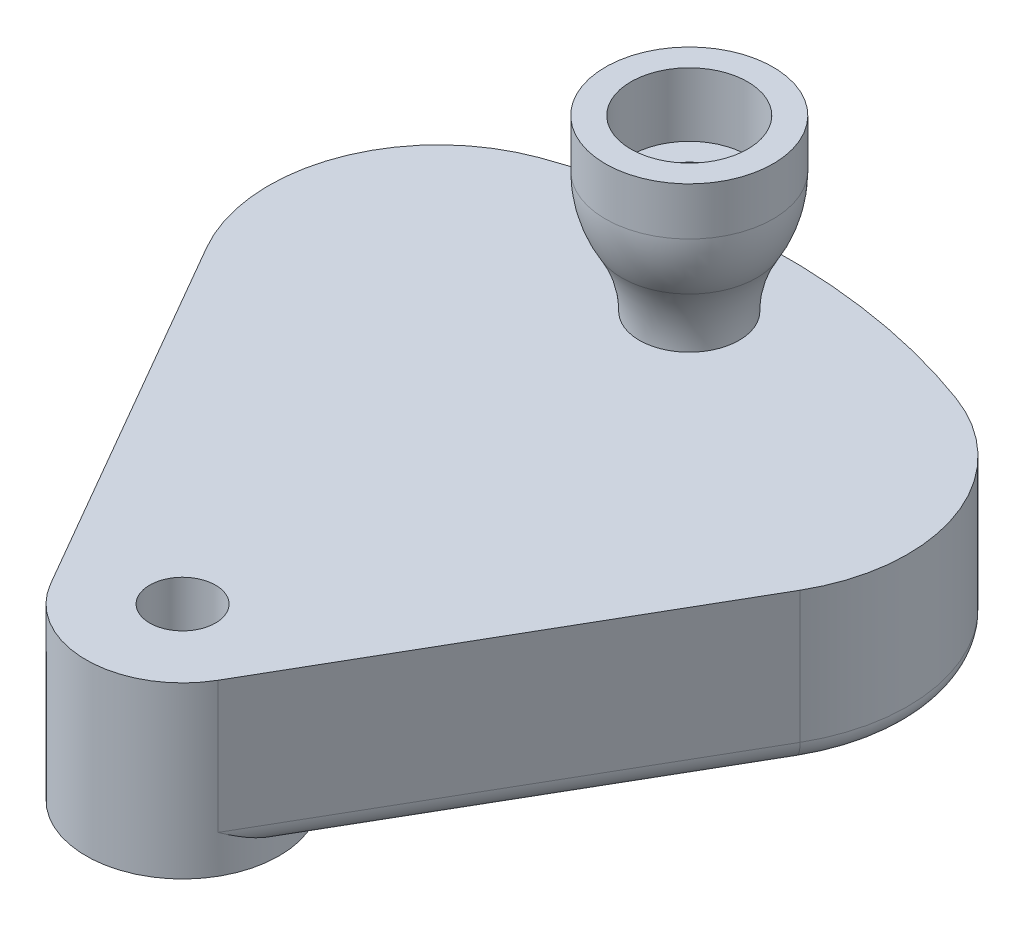
ISO-10303-21;
HEADER;
FILE_DESCRIPTION(('STEP AP214'),'2;1');
FILE_NAME('part.step','',(''),(''),'','','');
FILE_SCHEMA(('AUTOMOTIVE_DESIGN { 1 0 10303 214 1 1 1 1 }'));
ENDSEC;
DATA;
#1=APPLICATION_CONTEXT('core data for automotive mechanical design processes');
#2=APPLICATION_PROTOCOL_DEFINITION('international standard','automotive_design',2000,#1);
#3=PRODUCT_CONTEXT('',#1,'mechanical');
#4=PRODUCT('Part','Part','',(#3));
#5=PRODUCT_RELATED_PRODUCT_CATEGORY('part','',(#4));
#6=PRODUCT_DEFINITION_FORMATION('','',#4);
#7=PRODUCT_DEFINITION_CONTEXT('part definition',#1,'design');
#8=PRODUCT_DEFINITION('design','',#6,#7);
#9=PRODUCT_DEFINITION_SHAPE('','',#8);
#10=(LENGTH_UNIT() NAMED_UNIT(*) SI_UNIT(.MILLI.,.METRE.));
#11=(NAMED_UNIT(*) PLANE_ANGLE_UNIT() SI_UNIT($,.RADIAN.));
#12=(NAMED_UNIT(*) SI_UNIT($,.STERADIAN.) SOLID_ANGLE_UNIT());
#13=UNCERTAINTY_MEASURE_WITH_UNIT(LENGTH_MEASURE(1.E-05),#10,'distance_accuracy_value','');
#14=(GEOMETRIC_REPRESENTATION_CONTEXT(3) GLOBAL_UNCERTAINTY_ASSIGNED_CONTEXT((#13)) GLOBAL_UNIT_ASSIGNED_CONTEXT((#10,
#11,#12)) REPRESENTATION_CONTEXT('',''));
#15=CARTESIAN_POINT('',(0.,0.,0.));
#16=DIRECTION('',(0.,0.,1.));
#17=DIRECTION('',(1.,0.,0.));
#18=AXIS2_PLACEMENT_3D('',#15,#16,#17);
#19=CARTESIAN_POINT('',(0.,15.4876145564649,-23.867278685133));
#20=DIRECTION('',(0.,1.,0.));
#21=DIRECTION('',(0.,0.,1.));
#22=AXIS2_PLACEMENT_3D('',#19,#20,#21);
#23=CYLINDRICAL_SURFACE('',#22,1.55);
#24=CARTESIAN_POINT('',(0.,8.,-23.867278685133));
#25=DIRECTION('',(0.,1.,0.));
#26=DIRECTION('',(0.,0.,1.));
#27=AXIS2_PLACEMENT_3D('',#24,#25,#26);
#28=CIRCLE('',#27,1.55);
#29=CARTESIAN_POINT('',(0.,8.,-22.317278685133));
#30=VERTEX_POINT('',#29);
#31=EDGE_CURVE('E79',#30,#30,#28,.T.);
#32=ORIENTED_EDGE('',*,*,#31,.F.);
#33=EDGE_LOOP('',(#32));
#34=FACE_BOUND('',#33,.T.);
#35=CARTESIAN_POINT('',(0.,13.,-23.867278685133));
#36=DIRECTION('',(0.,1.,0.));
#37=DIRECTION('',(0.,0.,1.));
#38=AXIS2_PLACEMENT_3D('',#35,#36,#37);
#39=CIRCLE('',#38,1.55);
#40=CARTESIAN_POINT('',(0.,13.,-22.317278685133));
#41=VERTEX_POINT('',#40);
#42=EDGE_CURVE('E11',#41,#41,#39,.T.);
#43=ORIENTED_EDGE('',*,*,#42,.T.);
#44=EDGE_LOOP('',(#43));
#45=FACE_BOUND('',#44,.T.);
#46=ADVANCED_FACE('F51',(#34,#45),#23,.F.);
#47=CARTESIAN_POINT('',(0.,13.,-26.617278685133));
#48=DIRECTION('',(0.,-1.,0.));
#49=DIRECTION('',(0.,0.,-1.));
#50=AXIS2_PLACEMENT_3D('',#47,#48,#49);
#51=PLANE('',#50);
#52=ORIENTED_EDGE('',*,*,#42,.F.);
#53=EDGE_LOOP('',(#52));
#54=FACE_BOUND('',#53,.T.);
#55=CARTESIAN_POINT('',(0.,13.,-23.867278685133));
#56=DIRECTION('',(0.,1.,0.));
#57=DIRECTION('',(0.,0.,1.));
#58=AXIS2_PLACEMENT_3D('',#55,#56,#57);
#59=CIRCLE('',#58,2.75);
#60=CARTESIAN_POINT('',(0.,13.,-21.117278685133));
#61=VERTEX_POINT('',#60);
#62=EDGE_CURVE('E57',#61,#61,#59,.T.);
#63=ORIENTED_EDGE('',*,*,#62,.T.);
#64=EDGE_LOOP('',(#63));
#65=FACE_BOUND('',#64,.T.);
#66=ADVANCED_FACE('F86',(#54,#65),#51,.F.);
#67=CARTESIAN_POINT('',(0.,15.4876145564649,-23.867278685133));
#68=DIRECTION('',(0.,1.,0.));
#69=DIRECTION('',(0.,0.,1.));
#70=AXIS2_PLACEMENT_3D('',#67,#68,#69);
#71=CYLINDRICAL_SURFACE('',#70,2.75);
#72=ORIENTED_EDGE('',*,*,#62,.F.);
#73=EDGE_LOOP('',(#72));
#74=FACE_BOUND('',#73,.T.);
#75=CARTESIAN_POINT('',(0.,16.,-23.867278685133));
#76=DIRECTION('',(0.,1.,0.));
#77=DIRECTION('',(0.,0.,1.));
#78=AXIS2_PLACEMENT_3D('',#75,#76,#77);
#79=CIRCLE('',#78,2.75);
#80=CARTESIAN_POINT('',(0.,16.,-21.117278685133));
#81=VERTEX_POINT('',#80);
#82=EDGE_CURVE('E61',#81,#81,#79,.T.);
#83=ORIENTED_EDGE('',*,*,#82,.T.);
#84=EDGE_LOOP('',(#83));
#85=FACE_BOUND('',#84,.T.);
#86=ADVANCED_FACE('F90',(#74,#85),#71,.F.);
#87=CARTESIAN_POINT('',(0.,16.,-27.817278685133));
#88=DIRECTION('',(0.,-1.,0.));
#89=DIRECTION('',(0.,0.,-1.));
#90=AXIS2_PLACEMENT_3D('',#87,#88,#89);
#91=PLANE('',#90);
#92=ORIENTED_EDGE('',*,*,#82,.F.);
#93=EDGE_LOOP('',(#92));
#94=FACE_BOUND('',#93,.T.);
#95=CARTESIAN_POINT('',(0.,16.,-23.867278685133));
#96=DIRECTION('',(0.,1.,0.));
#97=DIRECTION('',(0.,0.,1.));
#98=AXIS2_PLACEMENT_3D('',#95,#96,#97);
#99=CIRCLE('',#98,3.95);
#100=CARTESIAN_POINT('',(0.,16.,-19.917278685133));
#101=VERTEX_POINT('',#100);
#102=EDGE_CURVE('E65',#101,#101,#99,.T.);
#103=ORIENTED_EDGE('',*,*,#102,.T.);
#104=EDGE_LOOP('',(#103));
#105=FACE_BOUND('',#104,.T.);
#106=ADVANCED_FACE('F95',(#94,#105),#91,.F.);
#107=CARTESIAN_POINT('',(0.,15.4876145564649,-23.867278685133));
#108=DIRECTION('',(0.,1.,0.));
#109=DIRECTION('',(0.,0.,1.));
#110=AXIS2_PLACEMENT_3D('',#107,#108,#109);
#111=CYLINDRICAL_SURFACE('',#110,3.95);
#112=ORIENTED_EDGE('',*,*,#102,.F.);
#113=EDGE_LOOP('',(#112));
#114=FACE_BOUND('',#113,.T.);
#115=CARTESIAN_POINT('',(0.,13.7490096920199,-23.867278685133));
#116=DIRECTION('',(0.,1.,0.));
#117=DIRECTION('',(0.,0.,1.));
#118=AXIS2_PLACEMENT_3D('',#115,#116,#117);
#119=CIRCLE('',#118,3.95);
#120=CARTESIAN_POINT('',(0.,13.7490096920199,-19.917278685133));
#121=VERTEX_POINT('',#120);
#122=EDGE_CURVE('E70',#121,#121,#119,.T.);
#123=ORIENTED_EDGE('',*,*,#122,.T.);
#124=EDGE_LOOP('',(#123));
#125=FACE_BOUND('',#124,.T.);
#126=ADVANCED_FACE('F101',(#114,#125),#111,.T.);
#127=CARTESIAN_POINT('',(0.,13.7490096920199,-23.867278685133));
#128=DIRECTION('',(0.,1.,0.));
#129=DIRECTION('',(0.,0.,1.));
#130=AXIS2_PLACEMENT_3D('',#127,#128,#129);
#131=DEGENERATE_TOROIDAL_SURFACE('',#130,1.45788075780529,5.40788075780529,.F.);
#132=ORIENTED_EDGE('',*,*,#122,.F.);
#133=EDGE_LOOP('',(#132));
#134=FACE_BOUND('',#133,.T.);
#135=CARTESIAN_POINT('',(0.,10.9552787009338,-23.867278685133));
#136=DIRECTION('',(0.,1.,0.));
#137=DIRECTION('',(0.,0.,1.));
#138=AXIS2_PLACEMENT_3D('',#135,#136,#137);
#139=CIRCLE('',#138,3.17248007479577);
#140=CARTESIAN_POINT('',(0.,10.9552787009338,-20.6947986103372));
#141=VERTEX_POINT('',#140);
#142=EDGE_CURVE('E73',#141,#141,#139,.T.);
#143=ORIENTED_EDGE('',*,*,#142,.T.);
#144=EDGE_LOOP('',(#143));
#145=FACE_BOUND('',#144,.T.);
#146=ADVANCED_FACE('F105',(#134,#145),#131,.F.);
#147=CARTESIAN_POINT('',(0.,8.,-23.867278685133));
#148=DIRECTION('',(0.,1.,0.));
#149=DIRECTION('',(0.,0.,1.));
#150=AXIS2_PLACEMENT_3D('',#147,#148,#149);
#151=TOROIDAL_SURFACE('',#150,8.07059187936306,5.72059187936306);
#152=ORIENTED_EDGE('',*,*,#142,.F.);
#153=EDGE_LOOP('',(#152));
#154=FACE_BOUND('',#153,.T.);
#155=CARTESIAN_POINT('',(0.,8.,-23.867278685133));
#156=DIRECTION('',(0.,1.,0.));
#157=DIRECTION('',(0.,0.,1.));
#158=AXIS2_PLACEMENT_3D('',#155,#156,#157);
#159=CIRCLE('',#158,2.35);
#160=CARTESIAN_POINT('',(0.,8.,-21.517278685133));
#161=VERTEX_POINT('',#160);
#162=EDGE_CURVE('E76',#161,#161,#159,.T.);
#163=ORIENTED_EDGE('',*,*,#162,.T.);
#164=EDGE_LOOP('',(#163));
#165=FACE_BOUND('',#164,.T.);
#166=ADVANCED_FACE('F109',(#154,#165),#151,.F.);
#167=CARTESIAN_POINT('',(0.,8.,-25.417278685133));
#168=DIRECTION('',(0.,1.,0.));
#169=DIRECTION('',(0.,0.,1.));
#170=AXIS2_PLACEMENT_3D('',#167,#168,#169);
#171=PLANE('',#170);
#172=ORIENTED_EDGE('',*,*,#162,.F.);
#173=EDGE_LOOP('',(#172));
#174=FACE_BOUND('',#173,.T.);
#175=ORIENTED_EDGE('',*,*,#31,.T.);
#176=EDGE_LOOP('',(#175));
#177=FACE_BOUND('',#176,.T.);
#178=ADVANCED_FACE('F83',(#174,#177),#171,.F.);
#179=CLOSED_SHELL('',(#46,#66,#86,#106,#126,#146,#166,#178));
#180=MANIFOLD_SOLID_BREP('B2',#179);
#181=CARTESIAN_POINT('',(0.,8.,0.));
#182=DIRECTION('',(0.,-1.,0.));
#183=DIRECTION('',(0.,0.,-1.));
#184=AXIS2_PLACEMENT_3D('',#181,#182,#183);
#185=PLANE('',#184);
#186=CARTESIAN_POINT('',(0.,8.,-23.867278685133));
#187=DIRECTION('',(0.,1.,0.));
#188=DIRECTION('',(0.,0.,1.));
#189=AXIS2_PLACEMENT_3D('',#186,#187,#188);
#190=CIRCLE('',#189,1.25);
#191=CARTESIAN_POINT('',(0.,8.,-22.617278685133));
#192=VERTEX_POINT('',#191);
#193=EDGE_CURVE('E487',#192,#192,#190,.T.);
#194=ORIENTED_EDGE('',*,*,#193,.F.);
#195=EDGE_LOOP('',(#194));
#196=FACE_BOUND('',#195,.T.);
#197=DIRECTION('',(0.499999999999998,0.,0.86602540378444));
#198=VECTOR('',#197,1.);
#199=CARTESIAN_POINT('',(-17.9404155872191,8.,-21.9737113059643));
#200=LINE('',#199,#198);
#201=CARTESIAN_POINT('',(-13.976893318947,8.,-15.1086893603862));
#202=VERTEX_POINT('',#201);
#203=CARTESIAN_POINT('',(-3.9404155872192,8.,2.27499999999999));
#204=VERTEX_POINT('',#203);
#205=EDGE_CURVE('E282',#202,#204,#200,.T.);
#206=ORIENTED_EDGE('',*,*,#205,.T.);
#207=CARTESIAN_POINT('',(0.,8.,0.));
#208=DIRECTION('',(0.,1.,0.));
#209=DIRECTION('',(0.,0.,1.));
#210=AXIS2_PLACEMENT_3D('',#207,#208,#209);
#211=CIRCLE('',#210,4.55);
#212=CARTESIAN_POINT('',(3.9404155872192,8.,2.27499999999999));
#213=VERTEX_POINT('',#212);
#214=EDGE_CURVE('E287',#204,#213,#211,.T.);
#215=ORIENTED_EDGE('',*,*,#214,.T.);
#216=DIRECTION('',(0.499999999999998,0.,-0.86602540378444));
#217=VECTOR('',#216,1.);
#218=CARTESIAN_POINT('',(3.9404155872192,8.,2.27499999999999));
#219=LINE('',#218,#217);
#220=CARTESIAN_POINT('',(13.976893318947,8.,-15.1086893603862));
#221=VERTEX_POINT('',#220);
#222=EDGE_CURVE('E307',#213,#221,#219,.T.);
#223=ORIENTED_EDGE('',*,*,#222,.T.);
#224=CARTESIAN_POINT('',(7.04869008867144,8.,-19.1086893603862));
#225=DIRECTION('',(0.,-1.,0.));
#226=DIRECTION('',(0.,0.,-1.));
#227=AXIS2_PLACEMENT_3D('',#224,#225,#226);
#228=CIRCLE('',#227,8.);
#229=CARTESIAN_POINT('',(9.81732312900652,8.,-26.6143319769757));
#230=VERTEX_POINT('',#229);
#231=EDGE_CURVE('E319',#221,#230,#228,.F.);
#232=ORIENTED_EDGE('',*,*,#231,.T.);
#233=CARTESIAN_POINT('',(0.,8.,0.));
#234=DIRECTION('',(0.,1.,0.));
#235=DIRECTION('',(0.,0.,-1.));
#236=AXIS2_PLACEMENT_3D('',#233,#234,#235);
#237=CIRCLE('',#236,28.367278685133);
#238=CARTESIAN_POINT('',(-9.81732312900651,8.,-26.6143319769757));
#239=VERTEX_POINT('',#238);
#240=EDGE_CURVE('E294',#230,#239,#237,.T.);
#241=ORIENTED_EDGE('',*,*,#240,.T.);
#242=CARTESIAN_POINT('',(-7.04869008867144,8.,-19.1086893603862));
#243=DIRECTION('',(0.,-1.,0.));
#244=DIRECTION('',(0.,0.,-1.));
#245=AXIS2_PLACEMENT_3D('',#242,#243,#244);
#246=CIRCLE('',#245,8.);
#247=EDGE_CURVE('E290',#239,#202,#246,.F.);
#248=ORIENTED_EDGE('',*,*,#247,.T.);
#249=EDGE_LOOP('',(#206,#215,#223,#232,#241,#248));
#250=FACE_BOUND('',#249,.T.);
#251=CARTESIAN_POINT('',(0.,8.,0.));
#252=DIRECTION('',(0.,1.,0.));
#253=DIRECTION('',(0.,0.,1.));
#254=AXIS2_PLACEMENT_3D('',#251,#252,#253);
#255=CIRCLE('',#254,1.55);
#256=CARTESIAN_POINT('',(0.,8.,1.55));
#257=VERTEX_POINT('',#256);
#258=EDGE_CURVE('E479',#257,#257,#255,.T.);
#259=ORIENTED_EDGE('',*,*,#258,.F.);
#260=EDGE_LOOP('',(#259));
#261=FACE_BOUND('',#260,.T.);
#262=ADVANCED_FACE('F172',(#196,#250,#261),#185,.F.);
#263=CARTESIAN_POINT('',(0.,0.,0.));
#264=DIRECTION('',(0.,-1.,0.));
#265=DIRECTION('',(0.,0.,-1.));
#266=AXIS2_PLACEMENT_3D('',#263,#264,#265);
#267=PLANE('',#266);
#268=CARTESIAN_POINT('',(0.,0.,-23.867278685133));
#269=DIRECTION('',(0.,-1.,0.));
#270=DIRECTION('',(0.,0.,-1.));
#271=AXIS2_PLACEMENT_3D('',#268,#269,#270);
#272=CIRCLE('',#271,1.25);
#273=CARTESIAN_POINT('',(0.,0.,-25.117278685133));
#274=VERTEX_POINT('',#273);
#275=EDGE_CURVE('E177',#274,#274,#272,.T.);
#276=ORIENTED_EDGE('',*,*,#275,.F.);
#277=EDGE_LOOP('',(#276));
#278=FACE_BOUND('',#277,.T.);
#279=CARTESIAN_POINT('',(0.,0.,0.));
#280=DIRECTION('',(0.,1.,0.));
#281=DIRECTION('',(0.,0.,1.));
#282=AXIS2_PLACEMENT_3D('',#279,#280,#281);
#283=CIRCLE('',#282,4.55);
#284=CARTESIAN_POINT('',(-3.35847888113417,0.,-3.06971001968847));
#285=VERTEX_POINT('',#284);
#286=CARTESIAN_POINT('',(3.35847888113417,0.,-3.06971001968847));
#287=VERTEX_POINT('',#286);
#288=EDGE_CURVE('E450',#285,#287,#283,.T.);
#289=ORIENTED_EDGE('',*,*,#288,.F.);
#290=DIRECTION('',(-0.499999999999998,0.,-0.86602540378444));
#291=VECTOR('',#290,1.);
#292=CARTESIAN_POINT('',(-1.18963573119971,0.,0.686836509645749));
#293=LINE('',#292,#291);
#294=CARTESIAN_POINT('',(-11.2261134629275,0.,-16.6968528507405));
#295=VERTEX_POINT('',#294);
#296=EDGE_CURVE('E350',#285,#295,#293,.T.);
#297=ORIENTED_EDGE('',*,*,#296,.T.);
#298=CARTESIAN_POINT('',(-7.04869008867144,0.,-19.1086893603862));
#299=DIRECTION('',(0.,-1.,0.));
#300=DIRECTION('',(0.,0.,-1.));
#301=AXIS2_PLACEMENT_3D('',#298,#299,#300);
#302=CIRCLE('',#301,4.8236730192915);
#303=CARTESIAN_POINT('',(-8.71806265079435,0.,-23.6342850831471));
#304=VERTEX_POINT('',#303);
#305=EDGE_CURVE('E348',#295,#304,#302,.T.);
#306=ORIENTED_EDGE('',*,*,#305,.T.);
#307=CARTESIAN_POINT('',(0.,0.,0.));
#308=DIRECTION('',(0.,-1.,0.));
#309=DIRECTION('',(0.,0.,-1.));
#310=AXIS2_PLACEMENT_3D('',#307,#308,#309);
#311=CIRCLE('',#310,25.1909517044245);
#312=CARTESIAN_POINT('',(8.71806265079436,0.,-23.6342850831471));
#313=VERTEX_POINT('',#312);
#314=EDGE_CURVE('E346',#304,#313,#311,.T.);
#315=ORIENTED_EDGE('',*,*,#314,.T.);
#316=CARTESIAN_POINT('',(7.04869008867144,0.,-19.1086893603862));
#317=DIRECTION('',(0.,-1.,0.));
#318=DIRECTION('',(0.,0.,-1.));
#319=AXIS2_PLACEMENT_3D('',#316,#317,#318);
#320=CIRCLE('',#319,4.8236730192915);
#321=CARTESIAN_POINT('',(11.2261134629275,0.,-16.6968528507405));
#322=VERTEX_POINT('',#321);
#323=EDGE_CURVE('E344',#313,#322,#320,.T.);
#324=ORIENTED_EDGE('',*,*,#323,.T.);
#325=DIRECTION('',(-0.499999999999998,0.,0.86602540378444));
#326=VECTOR('',#325,1.);
#327=CARTESIAN_POINT('',(1.18963573119971,0.,0.686836509645747));
#328=LINE('',#327,#326);
#329=EDGE_CURVE('E341',#322,#287,#328,.T.);
#330=ORIENTED_EDGE('',*,*,#329,.T.);
#331=EDGE_LOOP('',(#289,#297,#306,#315,#324,#330));
#332=FACE_BOUND('',#331,.T.);
#333=CARTESIAN_POINT('',(0.,0.,0.));
#334=DIRECTION('',(0.,1.,0.));
#335=DIRECTION('',(0.,0.,1.));
#336=AXIS2_PLACEMENT_3D('',#333,#334,#335);
#337=CIRCLE('',#336,1.55);
#338=CARTESIAN_POINT('',(0.,0.,1.55));
#339=VERTEX_POINT('',#338);
#340=EDGE_CURVE('E338',#339,#339,#337,.T.);
#341=ORIENTED_EDGE('',*,*,#340,.T.);
#342=EDGE_LOOP('',(#341));
#343=FACE_BOUND('',#342,.T.);
#344=ADVANCED_FACE('F496',(#278,#332,#343),#267,.T.);
#345=CARTESIAN_POINT('',(0.,8.,0.));
#346=DIRECTION('',(0.,-1.,0.));
#347=DIRECTION('',(0.,0.,-1.));
#348=AXIS2_PLACEMENT_3D('',#345,#346,#347);
#349=CYLINDRICAL_SURFACE('',#348,28.367278685133);
#350=DIRECTION('',(0.,-1.,0.));
#351=VECTOR('',#350,1.);
#352=CARTESIAN_POINT('',(9.81732312900652,8.,-26.6143319769757));
#353=LINE('',#352,#351);
#354=CARTESIAN_POINT('',(9.81732312900652,1.79211824100832,-26.6143319769757));
#355=VERTEX_POINT('',#354);
#356=EDGE_CURVE('E314',#230,#355,#353,.T.);
#357=ORIENTED_EDGE('',*,*,#356,.T.);
#358=CARTESIAN_POINT('',(0.,1.79211824100832,0.));
#359=DIRECTION('',(0.,-1.,0.));
#360=DIRECTION('',(0.,0.,-1.));
#361=AXIS2_PLACEMENT_3D('',#358,#359,#360);
#362=CIRCLE('',#361,28.367278685133);
#363=CARTESIAN_POINT('',(-9.81732312900652,1.79211824100832,-26.6143319769757));
#364=VERTEX_POINT('',#363);
#365=EDGE_CURVE('E372',#355,#364,#362,.F.);
#366=ORIENTED_EDGE('',*,*,#365,.T.);
#367=DIRECTION('',(0.,-1.,0.));
#368=VECTOR('',#367,1.);
#369=CARTESIAN_POINT('',(-9.81732312900652,8.,-26.6143319769757));
#370=LINE('',#369,#368);
#371=EDGE_CURVE('E317',#364,#239,#370,.F.);
#372=ORIENTED_EDGE('',*,*,#371,.T.);
#373=ORIENTED_EDGE('',*,*,#240,.F.);
#374=EDGE_LOOP('',(#357,#366,#372,#373));
#375=FACE_BOUND('',#374,.T.);
#376=ADVANCED_FACE('F477',(#375),#349,.T.);
#377=CARTESIAN_POINT('',(-17.9404155872191,8.,-21.9737113059643));
#378=DIRECTION('',(0.86602540378444,0.,-0.499999999999998));
#379=DIRECTION('',(-0.499999999999998,0.,-0.86602540378444));
#380=AXIS2_PLACEMENT_3D('',#377,#378,#379);
#381=PLANE('',#380);
#382=DIRECTION('',(0.,-1.,0.));
#383=VECTOR('',#382,1.);
#384=CARTESIAN_POINT('',(-13.976893318947,8.,-15.1086893603862));
#385=LINE('',#384,#383);
#386=CARTESIAN_POINT('',(-13.976893318947,1.79211824100832,-15.1086893603862));
#387=VERTEX_POINT('',#386);
#388=EDGE_CURVE('E302',#202,#387,#385,.T.);
#389=ORIENTED_EDGE('',*,*,#388,.T.);
#390=DIRECTION('',(0.499999999999998,0.,0.86602540378444));
#391=VECTOR('',#390,1.);
#392=CARTESIAN_POINT('',(-3.9404155872192,1.79211824100832,2.27499999999998));
#393=LINE('',#392,#391);
#394=CARTESIAN_POINT('',(-3.9404155872192,1.79211824100832,2.27499999999999));
#395=VERTEX_POINT('',#394);
#396=EDGE_CURVE('E301',#387,#395,#393,.T.);
#397=ORIENTED_EDGE('',*,*,#396,.T.);
#398=DIRECTION('',(0.,-1.,0.));
#399=VECTOR('',#398,1.);
#400=CARTESIAN_POINT('',(-3.9404155872192,8.,2.27499999999999));
#401=LINE('',#400,#399);
#402=EDGE_CURVE('E298',#204,#395,#401,.T.);
#403=ORIENTED_EDGE('',*,*,#402,.F.);
#404=ORIENTED_EDGE('',*,*,#205,.F.);
#405=EDGE_LOOP('',(#389,#397,#403,#404));
#406=FACE_BOUND('',#405,.T.);
#407=ADVANCED_FACE('F299',(#406),#381,.F.);
#408=CARTESIAN_POINT('',(0.,8.,0.));
#409=DIRECTION('',(0.,-1.,0.));
#410=DIRECTION('',(0.,0.,-1.));
#411=AXIS2_PLACEMENT_3D('',#408,#409,#410);
#412=CYLINDRICAL_SURFACE('',#411,4.55);
#413=ORIENTED_EDGE('',*,*,#402,.T.);
#414=CARTESIAN_POINT('',(-4.54900666334772,0.852425620222415,-0.0950703782363094));
#415=CARTESIAN_POINT('',(-4.55010571434,0.862346137581803,-0.0424861391402874));
#416=CARTESIAN_POINT('',(-4.55028849061516,0.873276055037117,0.00991146269022516));
#417=CARTESIAN_POINT('',(-4.54886430917114,0.896923986708722,0.114259091968286));
#418=CARTESIAN_POINT('',(-4.54725798348769,0.9096413680815,0.16620927094517));
#419=CARTESIAN_POINT('',(-4.53982899682654,0.950089988190823,0.321138995866665));
#420=CARTESIAN_POINT('',(-4.53140011118991,0.980156587716704,0.423395190455355));
#421=CARTESIAN_POINT('',(-4.50798230002393,1.04494428748881,0.62520660053963));
#422=CARTESIAN_POINT('',(-4.49301700204717,1.07964831383882,0.724770185265424));
#423=CARTESIAN_POINT('',(-4.45684533873488,1.15270081774431,0.921426668253095));
#424=CARTESIAN_POINT('',(-4.43563590091341,1.19105108316026,1.01851832456599));
#425=CARTESIAN_POINT('',(-4.35982884287327,1.3154774984093,1.3186533439724));
#426=CARTESIAN_POINT('',(-4.29463144654445,1.40639001953374,1.51708341582195));
#427=CARTESIAN_POINT('',(-4.13909692317108,1.5936825113926,1.90084370641525));
#428=CARTESIAN_POINT('',(-4.04877461403283,1.69005923291548,2.08618156600332));
#429=CARTESIAN_POINT('',(-3.94448249098935,1.78830060948113,2.26794496552112));
#430=CARTESIAN_POINT('',(-3.94245138138668,1.79020944482287,2.27147388027036));
#431=CARTESIAN_POINT('',(-3.94041558721918,1.79211824100832,2.27500000000002));
#432=B_SPLINE_CURVE_WITH_KNOTS('',3,(#414,#415,#416,#417,#418,#419,#420,#421,#422,#423,#424,
#425,#426,#427,#428,#429,#430,#431),.UNSPECIFIED.,.F.,.F.,(4,2,2,2,2,2,2,2,4),(0.,
0.16052686298664,0.320997034658452,0.641335844223975,0.960526167564304,1.27987381467197,
1.96110136865856,2.64192800415997,2.65541875169016),.UNSPECIFIED.);
#433=CARTESIAN_POINT('',(-4.54900666334772,0.852425620222415,-0.0950703782363095));
#434=VERTEX_POINT('',#433);
#435=EDGE_CURVE('E390',#395,#434,#432,.F.);
#436=ORIENTED_EDGE('',*,*,#435,.T.);
#437=CARTESIAN_POINT('',(0.,-0.564153863112596,0.));
#438=DIRECTION('',(-0.296198132726022,-0.939692620785909,0.171010071662833));
#439=DIRECTION('',(-0.813797681349376,0.342020143325667,0.469846310392953));
#440=AXIS2_PLACEMENT_3D('',#437,#438,#439);
#441=ELLIPSE('',#440,4.8420088647654,4.55);
#442=CARTESIAN_POINT('',(-3.59289917922499,0.0603073792140919,-2.79169759965588));
#443=VERTEX_POINT('',#442);
#444=EDGE_CURVE('E324',#434,#443,#441,.T.);
#445=ORIENTED_EDGE('',*,*,#444,.T.);
#446=CARTESIAN_POINT('',(-3.59289917922499,0.0603073792140917,-2.79169759965588));
#447=CARTESIAN_POINT('',(-3.57489686009448,0.0504145452792157,-2.81487027104703));
#448=CARTESIAN_POINT('',(-3.5564239989736,0.0416866660734862,-2.8381782799374));
#449=CARTESIAN_POINT('',(-3.51876849897644,0.026692147244714,-2.88472755820842));
#450=CARTESIAN_POINT('',(-3.49959166660288,0.020408868968025,-2.90796817057368));
#451=CARTESIAN_POINT('',(-3.46050604697851,0.0102953919880944,-2.95437264324323));
#452=CARTESIAN_POINT('',(-3.44059721705439,0.00646533654109237,-2.97753649898676));
#453=CARTESIAN_POINT('',(-3.40003501164597,0.00130775565283234,-3.02377592812745));
#454=CARTESIAN_POINT('',(-3.37937740958721,-2.11764915086206E-06,-3.04684975710325));
#455=CARTESIAN_POINT('',(-3.35847888113417,0.,-3.06971001968847));
#456=B_SPLINE_CURVE_WITH_KNOTS('',3,(#446,#447,#448,#449,#450,#451,#452,#453,#454,#455),
.UNSPECIFIED.,.F.,.F.,(4,2,2,2,4),(0.,0.0928777321668178,0.185111765339495,0.277351184038618,
0.370234357302657),.UNSPECIFIED.);
#457=EDGE_CURVE('E381',#443,#285,#456,.T.);
#458=ORIENTED_EDGE('',*,*,#457,.T.);
#459=ORIENTED_EDGE('',*,*,#288,.T.);
#460=CARTESIAN_POINT('',(3.35847888113416,0.,-3.06971001968847));
#461=CARTESIAN_POINT('',(3.37937740958721,-2.11764915120358E-06,-3.04684975710325));
#462=CARTESIAN_POINT('',(3.40003501164596,0.00130775565283195,-3.02377592812745));
#463=CARTESIAN_POINT('',(3.44059721705439,0.00646533654109208,-2.97753649898676));
#464=CARTESIAN_POINT('',(3.46050604697851,0.0102953919880943,-2.95437264324324));
#465=CARTESIAN_POINT('',(3.49959166660288,0.020408868968025,-2.90796817057368));
#466=CARTESIAN_POINT('',(3.51876849897644,0.0266921472447138,-2.88472755820842));
#467=CARTESIAN_POINT('',(3.5564239989736,0.0416866660734857,-2.8381782799374));
#468=CARTESIAN_POINT('',(3.57489686009448,0.0504145452792149,-2.81487027104703));
#469=CARTESIAN_POINT('',(3.59289917922499,0.0603073792140906,-2.79169759965588));
#470=B_SPLINE_CURVE_WITH_KNOTS('',3,(#460,#461,#462,#463,#464,#465,#466,#467,#468,#469),
.UNSPECIFIED.,.F.,.F.,(4,2,2,2,4),(0.,0.0928831732640387,0.185122591963163,0.27735662513584,
0.370234357302657),.UNSPECIFIED.);
#471=CARTESIAN_POINT('',(3.59289917922499,0.0603073792140908,-2.79169759965588));
#472=VERTEX_POINT('',#471);
#473=EDGE_CURVE('E182',#287,#472,#470,.T.);
#474=ORIENTED_EDGE('',*,*,#473,.T.);
#475=CARTESIAN_POINT('',(0.,-0.564153863112596,0.));
#476=DIRECTION('',(0.296198132726022,-0.939692620785909,0.171010071662833));
#477=DIRECTION('',(0.813797681349376,0.342020143325667,0.469846310392953));
#478=AXIS2_PLACEMENT_3D('',#475,#476,#477);
#479=ELLIPSE('',#478,4.8420088647654,4.55);
#480=CARTESIAN_POINT('',(4.54900666334772,0.852425620222414,-0.0950703782363123));
#481=VERTEX_POINT('',#480);
#482=EDGE_CURVE('E329',#472,#481,#479,.T.);
#483=ORIENTED_EDGE('',*,*,#482,.T.);
#484=CARTESIAN_POINT('',(4.54900666334772,0.852425620222415,-0.0950703782363117));
#485=CARTESIAN_POINT('',(4.55010571434,0.8623461375818,-0.0424861391403017));
#486=CARTESIAN_POINT('',(4.55028849061516,0.873276055037112,0.00991146269019861));
#487=CARTESIAN_POINT('',(4.54886430917115,0.896923986708712,0.114259091968236));
#488=CARTESIAN_POINT('',(4.5472579834877,0.909641368081487,0.166209270945108));
#489=CARTESIAN_POINT('',(4.53982899682655,0.9500899881908,0.321138995866573));
#490=CARTESIAN_POINT('',(4.53140011118992,0.98015658771667,0.423395190455246));
#491=CARTESIAN_POINT('',(4.50798230002395,1.04494428748877,0.625206600539524));
#492=CARTESIAN_POINT('',(4.49301700204718,1.0796483138388,0.724770185265338));
#493=CARTESIAN_POINT('',(4.45684533873489,1.15270081774429,0.921426668253056));
#494=CARTESIAN_POINT('',(4.43563590091341,1.19105108316023,1.01851832456598));
#495=CARTESIAN_POINT('',(4.35982884287328,1.31547749840935,1.31865334397237));
#496=CARTESIAN_POINT('',(4.29463144654454,1.40639001953408,1.51708341582181));
#497=CARTESIAN_POINT('',(4.139096923171,1.59368251139225,1.90084370641538));
#498=CARTESIAN_POINT('',(4.04877461403253,1.69005923291416,2.08618156600383));
#499=CARTESIAN_POINT('',(3.94448249098935,1.78830060948107,2.26794496552111));
#500=CARTESIAN_POINT('',(3.94245138138669,1.79020944482285,2.27147388027034));
#501=CARTESIAN_POINT('',(3.9404155872192,1.79211824100832,2.27499999999999));
#502=B_SPLINE_CURVE_WITH_KNOTS('',3,(#484,#485,#486,#487,#488,#489,#490,#491,#492,#493,#494,
#495,#496,#497,#498,#499,#500,#501),.UNSPECIFIED.,.F.,.F.,(4,2,2,2,2,2,2,2,4),(0.,
0.160526862986603,0.320997034658378,0.641335844223843,0.960526167564239,1.27987381467196,
1.96110136865856,2.64192800415994,2.65541875169013),.UNSPECIFIED.);
#503=CARTESIAN_POINT('',(3.9404155872192,1.79211824100832,2.27499999999999));
#504=VERTEX_POINT('',#503);
#505=EDGE_CURVE('E49',#481,#504,#502,.T.);
#506=ORIENTED_EDGE('',*,*,#505,.T.);
#507=DIRECTION('',(0.,-1.,0.));
#508=VECTOR('',#507,1.);
#509=CARTESIAN_POINT('',(3.9404155872192,8.,2.27499999999999));
#510=LINE('',#509,#508);
#511=EDGE_CURVE('E303',#213,#504,#510,.T.);
#512=ORIENTED_EDGE('',*,*,#511,.F.);
#513=ORIENTED_EDGE('',*,*,#214,.F.);
#514=EDGE_LOOP('',(#413,#436,#445,#458,#459,#474,#483,#506,#512,#513));
#515=FACE_BOUND('',#514,.T.);
#516=ADVANCED_FACE('F305',(#515),#412,.T.);
#517=CARTESIAN_POINT('',(3.9404155872192,8.,2.27499999999999));
#518=DIRECTION('',(-0.86602540378444,0.,-0.499999999999998));
#519=DIRECTION('',(-0.499999999999998,0.,0.86602540378444));
#520=AXIS2_PLACEMENT_3D('',#517,#518,#519);
#521=PLANE('',#520);
#522=ORIENTED_EDGE('',*,*,#511,.T.);
#523=DIRECTION('',(0.499999999999998,0.,-0.86602540378444));
#524=VECTOR('',#523,1.);
#525=CARTESIAN_POINT('',(13.976893318947,1.79211824100833,-15.1086893603862));
#526=LINE('',#525,#524);
#527=CARTESIAN_POINT('',(13.976893318947,1.79211824100833,-15.1086893603862));
#528=VERTEX_POINT('',#527);
#529=EDGE_CURVE('E379',#504,#528,#526,.T.);
#530=ORIENTED_EDGE('',*,*,#529,.T.);
#531=DIRECTION('',(0.,-1.,0.));
#532=VECTOR('',#531,1.);
#533=CARTESIAN_POINT('',(13.976893318947,8.,-15.1086893603862));
#534=LINE('',#533,#532);
#535=EDGE_CURVE('E322',#528,#221,#534,.F.);
#536=ORIENTED_EDGE('',*,*,#535,.T.);
#537=ORIENTED_EDGE('',*,*,#222,.F.);
#538=EDGE_LOOP('',(#522,#530,#536,#537));
#539=FACE_BOUND('',#538,.T.);
#540=ADVANCED_FACE('F470',(#539),#521,.F.);
#541=CARTESIAN_POINT('',(0.,8.,0.));
#542=DIRECTION('',(0.,-1.,0.));
#543=DIRECTION('',(0.,0.,-1.));
#544=AXIS2_PLACEMENT_3D('',#541,#542,#543);
#545=CYLINDRICAL_SURFACE('',#544,1.55);
#546=ORIENTED_EDGE('',*,*,#258,.T.);
#547=EDGE_LOOP('',(#546));
#548=FACE_BOUND('',#547,.T.);
#549=ORIENTED_EDGE('',*,*,#340,.F.);
#550=EDGE_LOOP('',(#549));
#551=FACE_BOUND('',#550,.T.);
#552=ADVANCED_FACE('F503',(#548,#551),#545,.F.);
#553=CARTESIAN_POINT('',(-7.04869008867144,8.,-19.1086893603862));
#554=DIRECTION('',(0.,-1.,0.));
#555=DIRECTION('',(0.,0.,-1.));
#556=AXIS2_PLACEMENT_3D('',#553,#554,#555);
#557=CYLINDRICAL_SURFACE('',#556,8.);
#558=ORIENTED_EDGE('',*,*,#371,.F.);
#559=CARTESIAN_POINT('',(-7.04869008867144,1.79211824100832,-19.1086893603862));
#560=DIRECTION('',(0.,-1.,0.));
#561=DIRECTION('',(0.,0.,-1.));
#562=AXIS2_PLACEMENT_3D('',#559,#560,#561);
#563=CIRCLE('',#562,8.);
#564=EDGE_CURVE('E370',#364,#387,#563,.F.);
#565=ORIENTED_EDGE('',*,*,#564,.T.);
#566=ORIENTED_EDGE('',*,*,#388,.F.);
#567=ORIENTED_EDGE('',*,*,#247,.F.);
#568=EDGE_LOOP('',(#558,#565,#566,#567));
#569=FACE_BOUND('',#568,.T.);
#570=ADVANCED_FACE('F505',(#569),#557,.T.);
#571=CARTESIAN_POINT('',(7.04869008867144,8.,-19.1086893603862));
#572=DIRECTION('',(0.,-1.,0.));
#573=DIRECTION('',(0.,0.,-1.));
#574=AXIS2_PLACEMENT_3D('',#571,#572,#573);
#575=CYLINDRICAL_SURFACE('',#574,8.);
#576=ORIENTED_EDGE('',*,*,#535,.F.);
#577=CARTESIAN_POINT('',(7.04869008867144,1.79211824100832,-19.1086893603862));
#578=DIRECTION('',(0.,-1.,0.));
#579=DIRECTION('',(0.,0.,-1.));
#580=AXIS2_PLACEMENT_3D('',#577,#578,#579);
#581=CIRCLE('',#580,8.);
#582=EDGE_CURVE('E374',#528,#355,#581,.F.);
#583=ORIENTED_EDGE('',*,*,#582,.T.);
#584=ORIENTED_EDGE('',*,*,#356,.F.);
#585=ORIENTED_EDGE('',*,*,#231,.F.);
#586=EDGE_LOOP('',(#576,#583,#584,#585));
#587=FACE_BOUND('',#586,.T.);
#588=ADVANCED_FACE('F473',(#587),#575,.T.);
#589=CARTESIAN_POINT('',(3.9404155872192,1.09191070279861,2.27499999999999));
#590=DIRECTION('',(0.296198132726022,-0.939692620785909,0.171010071662833));
#591=DIRECTION('',(-0.499999999999998,0.,0.86602540378444));
#592=AXIS2_PLACEMENT_3D('',#589,#590,#591);
#593=PLANE('',#592);
#594=ORIENTED_EDGE('',*,*,#482,.F.);
#595=DIRECTION('',(-0.499999999999998,0.,0.86602540378444));
#596=VECTOR('',#595,1.);
#597=CARTESIAN_POINT('',(1.48583386392573,0.060307379214091,0.857846581308579));
#598=LINE('',#597,#596);
#599=CARTESIAN_POINT('',(11.5223115956535,0.0603073792140899,-16.5258427790776));
#600=VERTEX_POINT('',#599);
#601=EDGE_CURVE('E377',#472,#600,#598,.F.);
#602=ORIENTED_EDGE('',*,*,#601,.T.);
#603=DIRECTION('',(-0.813797681349375,-0.342020143325667,-0.469846310392953));
#604=VECTOR('',#603,1.);
#605=CARTESIAN_POINT('',(13.976893318947,1.09191070279861,-15.1086893603862));
#606=LINE('',#605,#604);
#607=CARTESIAN_POINT('',(13.4070660478885,0.852425620222415,-15.4376792887234));
#608=VERTEX_POINT('',#607);
#609=EDGE_CURVE('E335',#608,#600,#606,.T.);
#610=ORIENTED_EDGE('',*,*,#609,.F.);
#611=DIRECTION('',(0.499999999999998,0.,-0.86602540378444));
#612=VECTOR('',#611,1.);
#613=CARTESIAN_POINT('',(3.37058831616078,0.852425620222415,1.94601007166282));
#614=LINE('',#613,#612);
#615=EDGE_CURVE('E196',#608,#481,#614,.F.);
#616=ORIENTED_EDGE('',*,*,#615,.T.);
#617=EDGE_LOOP('',(#594,#602,#610,#616));
#618=FACE_BOUND('',#617,.T.);
#619=ADVANCED_FACE('F408',(#618),#593,.T.);
#620=CARTESIAN_POINT('',(7.04869008867144,0.,-19.1086893603862));
#621=DIRECTION('',(0.,1.,0.));
#622=DIRECTION('',(0.,0.,1.));
#623=AXIS2_PLACEMENT_3D('',#620,#621,#622);
#624=CONICAL_SURFACE('',#623,4.99999999999997,1.22173047639603);
#625=ORIENTED_EDGE('',*,*,#609,.T.);
#626=CARTESIAN_POINT('',(7.04869008867144,0.0603073792140914,-19.1086893603862));
#627=DIRECTION('',(0.,-1.,0.));
#628=DIRECTION('',(0.,0.,-1.));
#629=AXIS2_PLACEMENT_3D('',#626,#627,#628);
#630=CIRCLE('',#629,5.16569316261717);
#631=CARTESIAN_POINT('',(8.8364286844533,0.0603073792140912,-23.9551702035818));
#632=VERTEX_POINT('',#631);
#633=EDGE_CURVE('E367',#600,#632,#630,.F.);
#634=ORIENTED_EDGE('',*,*,#633,.T.);
#635=DIRECTION('',(-0.325208004708366,-0.342020143325667,0.881624622633178));
#636=VECTOR('',#635,1.);
#637=CARTESIAN_POINT('',(9.81732312900652,1.09191070279861,-26.6143319769757));
#638=LINE('',#637,#636);
#639=CARTESIAN_POINT('',(9.58961003262358,0.852425620222413,-25.9970117703367));
#640=VERTEX_POINT('',#639);
#641=EDGE_CURVE('E332',#640,#632,#638,.T.);
#642=ORIENTED_EDGE('',*,*,#641,.F.);
#643=CARTESIAN_POINT('',(7.04869008867144,0.852425620222414,-19.1086893603862));
#644=DIRECTION('',(0.,-1.,0.));
#645=DIRECTION('',(0.,0.,-1.));
#646=AXIS2_PLACEMENT_3D('',#643,#644,#645);
#647=CIRCLE('',#646,7.34202014332567);
#648=EDGE_CURVE('E365',#640,#608,#647,.T.);
#649=ORIENTED_EDGE('',*,*,#648,.T.);
#650=EDGE_LOOP('',(#625,#634,#642,#649));
#651=FACE_BOUND('',#650,.T.);
#652=ADVANCED_FACE('F571',(#651),#624,.T.);
#653=CARTESIAN_POINT('',(-17.9404155872191,1.09191070279861,-21.9737113059643));
#654=DIRECTION('',(-0.296198132726022,-0.939692620785909,0.171010071662833));
#655=DIRECTION('',(-0.499999999999998,0.,-0.86602540378444));
#656=AXIS2_PLACEMENT_3D('',#653,#654,#655);
#657=PLANE('',#656);
#658=DIRECTION('',(-0.813797681349375,0.342020143325666,0.469846310392953));
#659=VECTOR('',#658,1.);
#660=CARTESIAN_POINT('',(-11.3788171075936,0.,-16.6086893603862));
#661=LINE('',#660,#659);
#662=CARTESIAN_POINT('',(-11.5223115956535,0.0603073792140904,-16.5258427790776));
#663=VERTEX_POINT('',#662);
#664=CARTESIAN_POINT('',(-13.4070660478885,0.852425620222412,-15.4376792887234));
#665=VERTEX_POINT('',#664);
#666=EDGE_CURVE('E328',#663,#665,#661,.T.);
#667=ORIENTED_EDGE('',*,*,#666,.F.);
#668=DIRECTION('',(-0.499999999999998,0.,-0.86602540378444));
#669=VECTOR('',#668,1.);
#670=CARTESIAN_POINT('',(-15.4858338639257,0.0603073792140919,-23.3908647246557));
#671=LINE('',#670,#669);
#672=EDGE_CURVE('E355',#663,#443,#671,.F.);
#673=ORIENTED_EDGE('',*,*,#672,.T.);
#674=ORIENTED_EDGE('',*,*,#444,.F.);
#675=DIRECTION('',(0.499999999999998,0.,0.86602540378444));
#676=VECTOR('',#675,1.);
#677=CARTESIAN_POINT('',(-13.4070660478885,0.852425620222415,-15.4376792887234));
#678=LINE('',#677,#676);
#679=EDGE_CURVE('E353',#434,#665,#678,.F.);
#680=ORIENTED_EDGE('',*,*,#679,.T.);
#681=EDGE_LOOP('',(#667,#673,#674,#680));
#682=FACE_BOUND('',#681,.T.);
#683=ADVANCED_FACE('F579',(#682),#657,.T.);
#684=CARTESIAN_POINT('',(0.,1.09191070279861,0.));
#685=DIRECTION('',(0.,1.,0.));
#686=DIRECTION('',(0.,0.,1.));
#687=AXIS2_PLACEMENT_3D('',#684,#685,#686);
#688=CONICAL_SURFACE('',#687,28.367278685133,1.22173047639603);
#689=ORIENTED_EDGE('',*,*,#641,.T.);
#690=CARTESIAN_POINT('',(0.,0.0603073792140897,0.));
#691=DIRECTION('',(0.,-1.,0.));
#692=DIRECTION('',(0.,0.,-1.));
#693=AXIS2_PLACEMENT_3D('',#690,#691,#692);
#694=CIRCLE('',#693,25.5329718477501);
#695=CARTESIAN_POINT('',(-8.8364286844533,0.0603073792140884,-23.9551702035818));
#696=VERTEX_POINT('',#695);
#697=EDGE_CURVE('E363',#632,#696,#694,.F.);
#698=ORIENTED_EDGE('',*,*,#697,.T.);
#699=DIRECTION('',(0.325208004708366,-0.342020143325667,0.881624622633178));
#700=VECTOR('',#699,1.);
#701=CARTESIAN_POINT('',(-9.81732312900651,1.09191070279861,-26.6143319769757));
#702=LINE('',#701,#700);
#703=CARTESIAN_POINT('',(-9.58961003262358,0.852425620222416,-25.9970117703367));
#704=VERTEX_POINT('',#703);
#705=EDGE_CURVE('E325',#704,#696,#702,.T.);
#706=ORIENTED_EDGE('',*,*,#705,.F.);
#707=CARTESIAN_POINT('',(0.,0.852425620222405,0.));
#708=DIRECTION('',(0.,1.,0.));
#709=DIRECTION('',(0.,0.,1.));
#710=AXIS2_PLACEMENT_3D('',#707,#708,#709);
#711=CIRCLE('',#710,27.7092988284586);
#712=EDGE_CURVE('E361',#704,#640,#711,.F.);
#713=ORIENTED_EDGE('',*,*,#712,.T.);
#714=EDGE_LOOP('',(#689,#698,#706,#713));
#715=FACE_BOUND('',#714,.T.);
#716=ADVANCED_FACE('F588',(#715),#688,.T.);
#717=CARTESIAN_POINT('',(-7.04869008867144,0.,-19.1086893603862));
#718=DIRECTION('',(0.,1.,0.));
#719=DIRECTION('',(0.,0.,1.));
#720=AXIS2_PLACEMENT_3D('',#717,#718,#719);
#721=CONICAL_SURFACE('',#720,4.99999999999997,1.22173047639603);
#722=ORIENTED_EDGE('',*,*,#705,.T.);
#723=CARTESIAN_POINT('',(-7.04869008867144,0.0603073792140914,-19.1086893603862));
#724=DIRECTION('',(0.,-1.,0.));
#725=DIRECTION('',(0.,0.,-1.));
#726=AXIS2_PLACEMENT_3D('',#723,#724,#725);
#727=CIRCLE('',#726,5.16569316261717);
#728=EDGE_CURVE('E359',#696,#663,#727,.F.);
#729=ORIENTED_EDGE('',*,*,#728,.T.);
#730=ORIENTED_EDGE('',*,*,#666,.T.);
#731=CARTESIAN_POINT('',(-7.04869008867144,0.852425620222414,-19.1086893603862));
#732=DIRECTION('',(0.,-1.,0.));
#733=DIRECTION('',(0.,0.,-1.));
#734=AXIS2_PLACEMENT_3D('',#731,#732,#733);
#735=CIRCLE('',#734,7.34202014332567);
#736=EDGE_CURVE('E357',#665,#704,#735,.T.);
#737=ORIENTED_EDGE('',*,*,#736,.T.);
#738=EDGE_LOOP('',(#722,#729,#730,#737));
#739=FACE_BOUND('',#738,.T.);
#740=ADVANCED_FACE('F424',(#739),#721,.T.);
#741=CARTESIAN_POINT('',(1.18963573119971,1.,0.686836509645747));
#742=DIRECTION('',(-0.499999999999998,0.,0.86602540378444));
#743=DIRECTION('',(0.86602540378444,0.,0.499999999999998));
#744=AXIS2_PLACEMENT_3D('',#741,#742,#743);
#745=CYLINDRICAL_SURFACE('',#744,1.);
#746=ORIENTED_EDGE('',*,*,#473,.F.);
#747=ORIENTED_EDGE('',*,*,#329,.F.);
#748=CARTESIAN_POINT('',(11.2261134629275,1.,-16.6968528507405));
#749=DIRECTION('',(0.499999999999997,0.,-0.86602540378444));
#750=DIRECTION('',(-0.86602540378444,0.,-0.499999999999997));
#751=AXIS2_PLACEMENT_3D('',#748,#749,#750);
#752=CIRCLE('',#751,1.);
#753=EDGE_CURVE('E447',#600,#322,#752,.T.);
#754=ORIENTED_EDGE('',*,*,#753,.F.);
#755=ORIENTED_EDGE('',*,*,#601,.F.);
#756=EDGE_LOOP('',(#746,#747,#754,#755));
#757=FACE_BOUND('',#756,.T.);
#758=ADVANCED_FACE('F420',(#757),#745,.T.);
#759=CARTESIAN_POINT('',(7.04869008867144,1.,-19.1086893603862));
#760=DIRECTION('',(0.,-1.,0.));
#761=DIRECTION('',(0.,0.,-1.));
#762=AXIS2_PLACEMENT_3D('',#759,#760,#761);
#763=TOROIDAL_SURFACE('',#762,4.8236730192915,1.);
#764=ORIENTED_EDGE('',*,*,#753,.T.);
#765=ORIENTED_EDGE('',*,*,#323,.F.);
#766=CARTESIAN_POINT('',(8.71806265079436,1.,-23.6342850831471));
#767=DIRECTION('',(-0.93820532707369,0.,-0.346079130041888));
#768=DIRECTION('',(-0.346079130041888,0.,0.93820532707369));
#769=AXIS2_PLACEMENT_3D('',#766,#767,#768);
#770=CIRCLE('',#769,1.);
#771=EDGE_CURVE('E444',#632,#313,#770,.T.);
#772=ORIENTED_EDGE('',*,*,#771,.F.);
#773=ORIENTED_EDGE('',*,*,#633,.F.);
#774=EDGE_LOOP('',(#764,#765,#772,#773));
#775=FACE_BOUND('',#774,.T.);
#776=ADVANCED_FACE('F416',(#775),#763,.T.);
#777=CARTESIAN_POINT('',(0.,1.,0.));
#778=DIRECTION('',(0.,-1.,0.));
#779=DIRECTION('',(0.,0.,-1.));
#780=AXIS2_PLACEMENT_3D('',#777,#778,#779);
#781=TOROIDAL_SURFACE('',#780,25.1909517044245,1.);
#782=ORIENTED_EDGE('',*,*,#771,.T.);
#783=ORIENTED_EDGE('',*,*,#314,.F.);
#784=CARTESIAN_POINT('',(-8.71806265079435,0.999999999999999,-23.6342850831471));
#785=DIRECTION('',(-0.938205327073691,0.,0.346079130041886));
#786=DIRECTION('',(0.346079130041886,0.,0.938205327073691));
#787=AXIS2_PLACEMENT_3D('',#784,#785,#786);
#788=CIRCLE('',#787,1.);
#789=EDGE_CURVE('E440',#696,#304,#788,.T.);
#790=ORIENTED_EDGE('',*,*,#789,.F.);
#791=ORIENTED_EDGE('',*,*,#697,.F.);
#792=EDGE_LOOP('',(#782,#783,#790,#791));
#793=FACE_BOUND('',#792,.T.);
#794=ADVANCED_FACE('F412',(#793),#781,.T.);
#795=CARTESIAN_POINT('',(-7.04869008867144,1.,-19.1086893603862));
#796=DIRECTION('',(0.,-1.,0.));
#797=DIRECTION('',(0.,0.,-1.));
#798=AXIS2_PLACEMENT_3D('',#795,#796,#797);
#799=TOROIDAL_SURFACE('',#798,4.8236730192915,1.);
#800=ORIENTED_EDGE('',*,*,#789,.T.);
#801=ORIENTED_EDGE('',*,*,#305,.F.);
#802=CARTESIAN_POINT('',(-11.2261134629275,1.,-16.6968528507405));
#803=DIRECTION('',(0.5,0.,0.866025403784439));
#804=DIRECTION('',(0.866025403784439,0.,-0.5));
#805=AXIS2_PLACEMENT_3D('',#802,#803,#804);
#806=CIRCLE('',#805,1.);
#807=EDGE_CURVE('E438',#663,#295,#806,.T.);
#808=ORIENTED_EDGE('',*,*,#807,.F.);
#809=ORIENTED_EDGE('',*,*,#728,.F.);
#810=EDGE_LOOP('',(#800,#801,#808,#809));
#811=FACE_BOUND('',#810,.T.);
#812=ADVANCED_FACE('F405',(#811),#799,.T.);
#813=CARTESIAN_POINT('',(-1.18963573119971,1.,0.686836509645748));
#814=DIRECTION('',(-0.499999999999998,0.,-0.86602540378444));
#815=DIRECTION('',(-0.86602540378444,0.,0.499999999999998));
#816=AXIS2_PLACEMENT_3D('',#813,#814,#815);
#817=CYLINDRICAL_SURFACE('',#816,1.);
#818=ORIENTED_EDGE('',*,*,#457,.F.);
#819=ORIENTED_EDGE('',*,*,#672,.F.);
#820=ORIENTED_EDGE('',*,*,#807,.T.);
#821=ORIENTED_EDGE('',*,*,#296,.F.);
#822=EDGE_LOOP('',(#818,#819,#820,#821));
#823=FACE_BOUND('',#822,.T.);
#824=ADVANCED_FACE('F400',(#823),#817,.T.);
#825=CARTESIAN_POINT('',(3.07439018343476,1.79211824100832,1.77499999999999));
#826=DIRECTION('',(-0.499999999999998,0.,0.86602540378444));
#827=DIRECTION('',(0.86602540378444,0.,0.499999999999998));
#828=AXIS2_PLACEMENT_3D('',#825,#826,#827);
#829=CYLINDRICAL_SURFACE('',#828,1.);
#830=ORIENTED_EDGE('',*,*,#505,.F.);
#831=ORIENTED_EDGE('',*,*,#615,.F.);
#832=CARTESIAN_POINT('',(13.1108679151625,1.79211824100833,-15.6086893603862));
#833=DIRECTION('',(0.499999999999999,0.,-0.866025403784439));
#834=DIRECTION('',(-0.866025403784439,0.,-0.499999999999999));
#835=AXIS2_PLACEMENT_3D('',#832,#833,#834);
#836=CIRCLE('',#835,1.);
#837=EDGE_CURVE('E441',#528,#608,#836,.T.);
#838=ORIENTED_EDGE('',*,*,#837,.F.);
#839=ORIENTED_EDGE('',*,*,#529,.F.);
#840=EDGE_LOOP('',(#830,#831,#838,#839));
#841=FACE_BOUND('',#840,.T.);
#842=ADVANCED_FACE('F174',(#841),#829,.T.);
#843=CARTESIAN_POINT('',(7.04869008867144,1.79211824100832,-19.1086893603862));
#844=DIRECTION('',(0.,-1.,0.));
#845=DIRECTION('',(0.,0.,-1.));
#846=AXIS2_PLACEMENT_3D('',#843,#844,#845);
#847=TOROIDAL_SURFACE('',#846,7.,1.);
#848=ORIENTED_EDGE('',*,*,#837,.T.);
#849=ORIENTED_EDGE('',*,*,#648,.F.);
#850=CARTESIAN_POINT('',(9.47124399896463,1.79211824100832,-25.6761266499021));
#851=DIRECTION('',(-0.938205327073692,0.,-0.346079130041884));
#852=DIRECTION('',(-0.346079130041884,0.,0.938205327073692));
#853=AXIS2_PLACEMENT_3D('',#850,#851,#852);
#854=CIRCLE('',#853,1.);
#855=EDGE_CURVE('E457',#355,#640,#854,.T.);
#856=ORIENTED_EDGE('',*,*,#855,.F.);
#857=ORIENTED_EDGE('',*,*,#582,.F.);
#858=EDGE_LOOP('',(#848,#849,#856,#857));
#859=FACE_BOUND('',#858,.T.);
#860=ADVANCED_FACE('F464',(#859),#847,.T.);
#861=CARTESIAN_POINT('',(0.,1.79211824100832,0.));
#862=DIRECTION('',(0.,-1.,0.));
#863=DIRECTION('',(0.,0.,-1.));
#864=AXIS2_PLACEMENT_3D('',#861,#862,#863);
#865=TOROIDAL_SURFACE('',#864,27.367278685133,1.);
#866=ORIENTED_EDGE('',*,*,#855,.T.);
#867=ORIENTED_EDGE('',*,*,#712,.F.);
#868=CARTESIAN_POINT('',(-9.47124399896463,1.79211824100832,-25.6761266499021));
#869=DIRECTION('',(-0.938205327073692,0.,0.346079130041884));
#870=DIRECTION('',(0.346079130041884,0.,0.938205327073692));
#871=AXIS2_PLACEMENT_3D('',#868,#869,#870);
#872=CIRCLE('',#871,1.);
#873=EDGE_CURVE('E454',#364,#704,#872,.T.);
#874=ORIENTED_EDGE('',*,*,#873,.F.);
#875=ORIENTED_EDGE('',*,*,#365,.F.);
#876=EDGE_LOOP('',(#866,#867,#874,#875));
#877=FACE_BOUND('',#876,.T.);
#878=ADVANCED_FACE('F653',(#877),#865,.T.);
#879=CARTESIAN_POINT('',(-7.04869008867144,1.79211824100832,-19.1086893603862));
#880=DIRECTION('',(0.,-1.,0.));
#881=DIRECTION('',(0.,0.,-1.));
#882=AXIS2_PLACEMENT_3D('',#879,#880,#881);
#883=TOROIDAL_SURFACE('',#882,7.,1.);
#884=ORIENTED_EDGE('',*,*,#873,.T.);
#885=ORIENTED_EDGE('',*,*,#736,.F.);
#886=CARTESIAN_POINT('',(-13.1108679151625,1.79211824100832,-15.6086893603862));
#887=DIRECTION('',(0.499999999999999,0.,0.866025403784439));
#888=DIRECTION('',(0.866025403784439,0.,-0.499999999999999));
#889=AXIS2_PLACEMENT_3D('',#886,#887,#888);
#890=CIRCLE('',#889,1.);
#891=EDGE_CURVE('E451',#387,#665,#890,.T.);
#892=ORIENTED_EDGE('',*,*,#891,.F.);
#893=ORIENTED_EDGE('',*,*,#564,.F.);
#894=EDGE_LOOP('',(#884,#885,#892,#893));
#895=FACE_BOUND('',#894,.T.);
#896=ADVANCED_FACE('F661',(#895),#883,.T.);
#897=CARTESIAN_POINT('',(-17.0743901834347,1.79211824100832,-22.4737113059643));
#898=DIRECTION('',(-0.499999999999998,0.,-0.86602540378444));
#899=DIRECTION('',(-0.86602540378444,0.,0.499999999999998));
#900=AXIS2_PLACEMENT_3D('',#897,#898,#899);
#901=CYLINDRICAL_SURFACE('',#900,1.);
#902=ORIENTED_EDGE('',*,*,#891,.T.);
#903=ORIENTED_EDGE('',*,*,#679,.F.);
#904=ORIENTED_EDGE('',*,*,#435,.F.);
#905=ORIENTED_EDGE('',*,*,#396,.F.);
#906=EDGE_LOOP('',(#902,#903,#904,#905));
#907=FACE_BOUND('',#906,.T.);
#908=ADVANCED_FACE('F426',(#907),#901,.T.);
#909=CARTESIAN_POINT('',(0.,-0.0620335978142681,-23.867278685133));
#910=DIRECTION('',(0.,1.,0.));
#911=DIRECTION('',(0.,0.,1.));
#912=AXIS2_PLACEMENT_3D('',#909,#910,#911);
#913=CYLINDRICAL_SURFACE('',#912,1.25);
#914=ORIENTED_EDGE('',*,*,#275,.T.);
#915=EDGE_LOOP('',(#914));
#916=FACE_BOUND('',#915,.T.);
#917=ORIENTED_EDGE('',*,*,#193,.T.);
#918=EDGE_LOOP('',(#917));
#919=FACE_BOUND('',#918,.T.);
#920=ADVANCED_FACE('F494',(#916,#919),#913,.F.);
#921=CLOSED_SHELL('',(#262,#344,#376,#407,#516,#540,#552,#570,#588,#619,#652,#683,#716,#740,
#758,#776,#794,#812,#824,#842,#860,#878,#896,#908,#920));
#922=MANIFOLD_SOLID_BREP('B6',#921);
#923=ADVANCED_BREP_SHAPE_REPRESENTATION('',(#18,#180,#922),#14);
#924=SHAPE_DEFINITION_REPRESENTATION(#9,#923);
ENDSEC;
END-ISO-10303-21;
